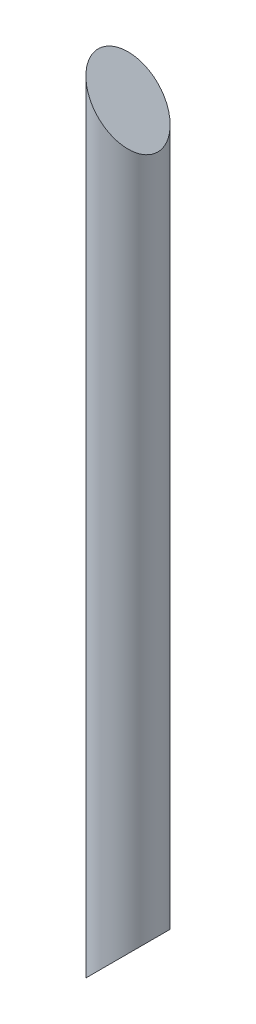
ISO-10303-21;
HEADER;
FILE_DESCRIPTION(('STEP AP214'),'2;1');
FILE_NAME('part.step','',(''),(''),'','','');
FILE_SCHEMA(('AUTOMOTIVE_DESIGN { 1 0 10303 214 1 1 1 1 }'));
ENDSEC;
DATA;
#1=APPLICATION_CONTEXT('core data for automotive mechanical design processes');
#2=APPLICATION_PROTOCOL_DEFINITION('international standard','automotive_design',2000,#1);
#3=PRODUCT_CONTEXT('',#1,'mechanical');
#4=PRODUCT('Part','Part','',(#3));
#5=PRODUCT_RELATED_PRODUCT_CATEGORY('part','',(#4));
#6=PRODUCT_DEFINITION_FORMATION('','',#4);
#7=PRODUCT_DEFINITION_CONTEXT('part definition',#1,'design');
#8=PRODUCT_DEFINITION('design','',#6,#7);
#9=PRODUCT_DEFINITION_SHAPE('','',#8);
#10=(LENGTH_UNIT() NAMED_UNIT(*) SI_UNIT(.MILLI.,.METRE.));
#11=(NAMED_UNIT(*) PLANE_ANGLE_UNIT() SI_UNIT($,.RADIAN.));
#12=(NAMED_UNIT(*) SI_UNIT($,.STERADIAN.) SOLID_ANGLE_UNIT());
#13=UNCERTAINTY_MEASURE_WITH_UNIT(LENGTH_MEASURE(1.E-05),#10,'distance_accuracy_value','');
#14=(GEOMETRIC_REPRESENTATION_CONTEXT(3) GLOBAL_UNCERTAINTY_ASSIGNED_CONTEXT((#13)) GLOBAL_UNIT_ASSIGNED_CONTEXT((#10,
#11,#12)) REPRESENTATION_CONTEXT('',''));
#15=CARTESIAN_POINT('',(0.,0.,0.));
#16=DIRECTION('',(0.,0.,1.));
#17=DIRECTION('',(1.,0.,0.));
#18=AXIS2_PLACEMENT_3D('',#15,#16,#17);
#19=CARTESIAN_POINT('',(0.,723.9,0.));
#20=DIRECTION('',(0.,-1.,0.));
#21=DIRECTION('',(0.,0.,-1.));
#22=AXIS2_PLACEMENT_3D('',#19,#20,#21);
#23=CYLINDRICAL_SURFACE('',#22,31.75);
#24=CARTESIAN_POINT('',(0.,755.65,0.));
#25=DIRECTION('',(-0.707106781186551,-0.707106781186544,0.));
#26=DIRECTION('',(0.707106781186544,-0.707106781186551,0.));
#27=AXIS2_PLACEMENT_3D('',#24,#25,#26);
#28=ELLIPSE('',#27,44.901280605346,31.75);
#29=CARTESIAN_POINT('',(31.75,723.9,0.));
#30=VERTEX_POINT('',#29);
#31=EDGE_CURVE('E10',#30,#30,#28,.T.);
#32=ORIENTED_EDGE('',*,*,#31,.T.);
#33=EDGE_LOOP('',(#32));
#34=FACE_BOUND('',#33,.T.);
#35=CARTESIAN_POINT('',(0.,-31.7500000000003,0.));
#36=DIRECTION('',(-0.707106781186551,0.707106781186544,0.));
#37=DIRECTION('',(-0.707106781186544,-0.707106781186551,0.));
#38=AXIS2_PLACEMENT_3D('',#35,#36,#37);
#39=ELLIPSE('',#38,44.901280605346,31.75);
#40=CARTESIAN_POINT('',(-31.75,-63.5000000000006,0.));
#41=VERTEX_POINT('',#40);
#42=EDGE_CURVE('E38',#41,#41,#39,.T.);
#43=ORIENTED_EDGE('',*,*,#42,.T.);
#44=EDGE_LOOP('',(#43));
#45=FACE_BOUND('',#44,.T.);
#46=ADVANCED_FACE('F32',(#34,#45),#23,.T.);
#47=CARTESIAN_POINT('',(377.825,377.824999999996,63.5));
#48=DIRECTION('',(-0.707106781186551,-0.707106781186544,0.));
#49=DIRECTION('',(0.707106781186544,-0.707106781186551,0.));
#50=AXIS2_PLACEMENT_3D('',#47,#48,#49);
#51=PLANE('',#50);
#52=ORIENTED_EDGE('',*,*,#31,.F.);
#53=EDGE_LOOP('',(#52));
#54=FACE_BOUND('',#53,.T.);
#55=ADVANCED_FACE('F47',(#54),#51,.F.);
#56=CARTESIAN_POINT('',(15.8750000000002,-15.875,63.5));
#57=DIRECTION('',(-0.707106781186551,0.707106781186544,0.));
#58=DIRECTION('',(-0.707106781186544,-0.707106781186551,0.));
#59=AXIS2_PLACEMENT_3D('',#56,#57,#58);
#60=PLANE('',#59);
#61=ORIENTED_EDGE('',*,*,#42,.F.);
#62=EDGE_LOOP('',(#61));
#63=FACE_BOUND('',#62,.T.);
#64=ADVANCED_FACE('F45',(#63),#60,.F.);
#65=CLOSED_SHELL('',(#46,#55,#64));
#66=MANIFOLD_SOLID_BREP('B2',#65);
#67=ADVANCED_BREP_SHAPE_REPRESENTATION('',(#18,#66),#14);
#68=SHAPE_DEFINITION_REPRESENTATION(#9,#67);
ENDSEC;
END-ISO-10303-21;
